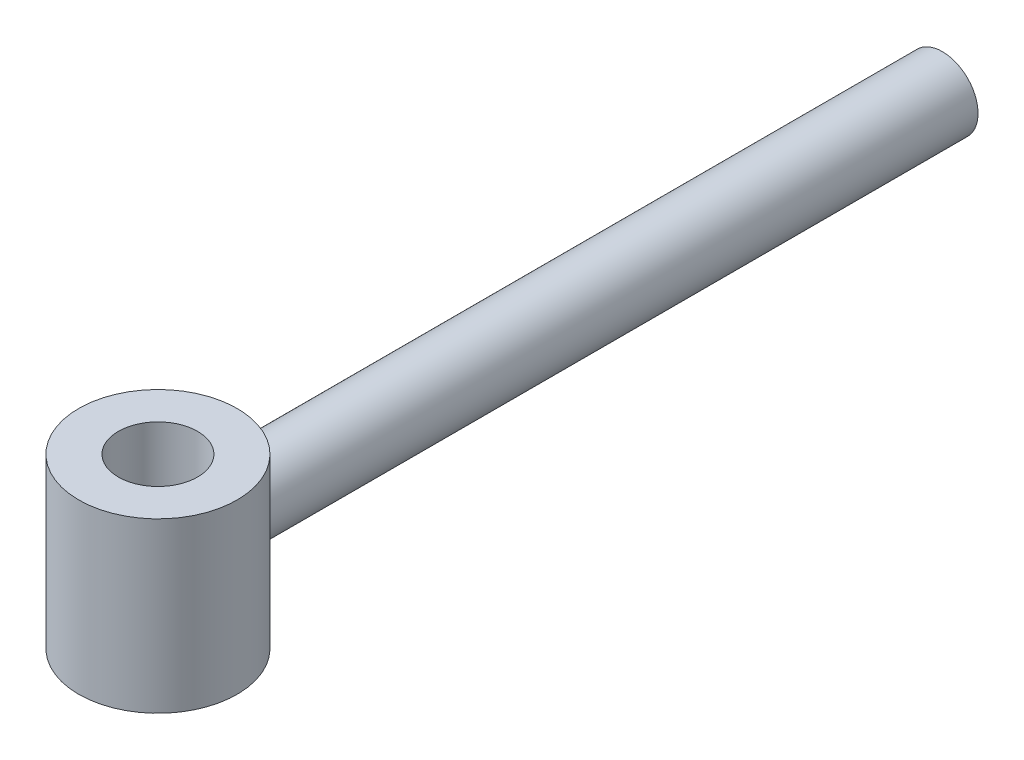
ISO-10303-21;
HEADER;
FILE_DESCRIPTION(('STEP AP214'),'2;1');
FILE_NAME('part.step','',(''),(''),'','','');
FILE_SCHEMA(('AUTOMOTIVE_DESIGN { 1 0 10303 214 1 1 1 1 }'));
ENDSEC;
DATA;
#1=APPLICATION_CONTEXT('core data for automotive mechanical design processes');
#2=APPLICATION_PROTOCOL_DEFINITION('international standard','automotive_design',2000,#1);
#3=PRODUCT_CONTEXT('',#1,'mechanical');
#4=PRODUCT('Part','Part','',(#3));
#5=PRODUCT_RELATED_PRODUCT_CATEGORY('part','',(#4));
#6=PRODUCT_DEFINITION_FORMATION('','',#4);
#7=PRODUCT_DEFINITION_CONTEXT('part definition',#1,'design');
#8=PRODUCT_DEFINITION('design','',#6,#7);
#9=PRODUCT_DEFINITION_SHAPE('','',#8);
#10=(LENGTH_UNIT() NAMED_UNIT(*) SI_UNIT(.MILLI.,.METRE.));
#11=(NAMED_UNIT(*) PLANE_ANGLE_UNIT() SI_UNIT($,.RADIAN.));
#12=(NAMED_UNIT(*) SI_UNIT($,.STERADIAN.) SOLID_ANGLE_UNIT());
#13=UNCERTAINTY_MEASURE_WITH_UNIT(LENGTH_MEASURE(1.E-05),#10,'distance_accuracy_value','');
#14=(GEOMETRIC_REPRESENTATION_CONTEXT(3) GLOBAL_UNCERTAINTY_ASSIGNED_CONTEXT((#13)) GLOBAL_UNIT_ASSIGNED_CONTEXT((#10,
#11,#12)) REPRESENTATION_CONTEXT('',''));
#15=CARTESIAN_POINT('',(0.,0.,0.));
#16=DIRECTION('',(0.,0.,1.));
#17=DIRECTION('',(1.,0.,0.));
#18=AXIS2_PLACEMENT_3D('',#15,#16,#17);
#19=CARTESIAN_POINT('',(0.,40.,-27.));
#20=DIRECTION('',(0.,0.,-1.));
#21=DIRECTION('',(-1.,0.,0.));
#22=AXIS2_PLACEMENT_3D('',#19,#20,#21);
#23=CYLINDRICAL_SURFACE('',#22,18.);
#24=CARTESIAN_POINT('',(0.,40.,-27.));
#25=DIRECTION('',(0.,0.,-1.));
#26=DIRECTION('',(-1.,0.,0.));
#27=AXIS2_PLACEMENT_3D('',#24,#25,#26);
#28=CIRCLE('',#27,18.);
#29=CARTESIAN_POINT('',(-18.,40.,-27.));
#30=VERTEX_POINT('',#29);
#31=EDGE_CURVE('E11',#30,#30,#28,.T.);
#32=ORIENTED_EDGE('',*,*,#31,.T.);
#33=EDGE_LOOP('',(#32));
#34=FACE_BOUND('',#33,.T.);
#35=CARTESIAN_POINT('',(0.,40.,-396.));
#36=DIRECTION('',(0.,0.,-1.));
#37=DIRECTION('',(-1.,0.,0.));
#38=AXIS2_PLACEMENT_3D('',#35,#36,#37);
#39=CIRCLE('',#38,18.);
#40=CARTESIAN_POINT('',(-18.,40.,-396.));
#41=VERTEX_POINT('',#40);
#42=EDGE_CURVE('E50',#41,#41,#39,.T.);
#43=ORIENTED_EDGE('',*,*,#42,.F.);
#44=EDGE_LOOP('',(#43));
#45=FACE_BOUND('',#44,.T.);
#46=ADVANCED_FACE('F44',(#34,#45),#23,.T.);
#47=CARTESIAN_POINT('',(0.,40.,-27.));
#48=DIRECTION('',(0.,0.,-1.));
#49=DIRECTION('',(-1.,0.,0.));
#50=AXIS2_PLACEMENT_3D('',#47,#48,#49);
#51=PLANE('',#50);
#52=ORIENTED_EDGE('',*,*,#31,.F.);
#53=EDGE_LOOP('',(#52));
#54=FACE_BOUND('',#53,.T.);
#55=ADVANCED_FACE('F59',(#54),#51,.F.);
#56=CARTESIAN_POINT('',(0.,40.,-396.));
#57=DIRECTION('',(0.,0.,-1.));
#58=DIRECTION('',(-1.,0.,0.));
#59=AXIS2_PLACEMENT_3D('',#56,#57,#58);
#60=PLANE('',#59);
#61=ORIENTED_EDGE('',*,*,#42,.T.);
#62=EDGE_LOOP('',(#61));
#63=FACE_BOUND('',#62,.T.);
#64=ADVANCED_FACE('F56',(#63),#60,.T.);
#65=CLOSED_SHELL('',(#46,#55,#64));
#66=MANIFOLD_SOLID_BREP('B2',#65);
#67=CARTESIAN_POINT('',(0.,-5.,0.));
#68=DIRECTION('',(0.,1.,0.));
#69=DIRECTION('',(0.,0.,1.));
#70=AXIS2_PLACEMENT_3D('',#67,#68,#69);
#71=CYLINDRICAL_SURFACE('',#70,40.);
#72=CARTESIAN_POINT('',(0.,-5.,0.));
#73=DIRECTION('',(0.,1.,0.));
#74=DIRECTION('',(0.,0.,1.));
#75=AXIS2_PLACEMENT_3D('',#72,#73,#74);
#76=CIRCLE('',#75,40.);
#77=CARTESIAN_POINT('',(0.,-5.,40.));
#78=VERTEX_POINT('',#77);
#79=EDGE_CURVE('E43',#78,#78,#76,.T.);
#80=ORIENTED_EDGE('',*,*,#79,.T.);
#81=EDGE_LOOP('',(#80));
#82=FACE_BOUND('',#81,.T.);
#83=CARTESIAN_POINT('',(0.,80.,0.));
#84=DIRECTION('',(0.,1.,0.));
#85=DIRECTION('',(0.,0.,1.));
#86=AXIS2_PLACEMENT_3D('',#83,#84,#85);
#87=CIRCLE('',#86,40.);
#88=CARTESIAN_POINT('',(0.,80.,40.));
#89=VERTEX_POINT('',#88);
#90=EDGE_CURVE('E100',#89,#89,#87,.T.);
#91=ORIENTED_EDGE('',*,*,#90,.F.);
#92=EDGE_LOOP('',(#91));
#93=FACE_BOUND('',#92,.T.);
#94=ADVANCED_FACE('F90',(#82,#93),#71,.T.);
#95=CARTESIAN_POINT('',(0.,-5.,0.));
#96=DIRECTION('',(0.,1.,0.));
#97=DIRECTION('',(0.,0.,1.));
#98=AXIS2_PLACEMENT_3D('',#95,#96,#97);
#99=PLANE('',#98);
#100=CARTESIAN_POINT('',(0.,-5.,0.));
#101=DIRECTION('',(0.,1.,0.));
#102=DIRECTION('',(0.,0.,1.));
#103=AXIS2_PLACEMENT_3D('',#100,#101,#102);
#104=CIRCLE('',#103,20.);
#105=CARTESIAN_POINT('',(0.,-5.,20.));
#106=VERTEX_POINT('',#105);
#107=EDGE_CURVE('E96',#106,#106,#104,.T.);
#108=ORIENTED_EDGE('',*,*,#107,.T.);
#109=EDGE_LOOP('',(#108));
#110=FACE_BOUND('',#109,.T.);
#111=ORIENTED_EDGE('',*,*,#79,.F.);
#112=EDGE_LOOP('',(#111));
#113=FACE_BOUND('',#112,.T.);
#114=ADVANCED_FACE('F119',(#110,#113),#99,.F.);
#115=CARTESIAN_POINT('',(0.,-5.,0.));
#116=DIRECTION('',(0.,1.,0.));
#117=DIRECTION('',(0.,0.,1.));
#118=AXIS2_PLACEMENT_3D('',#115,#116,#117);
#119=CYLINDRICAL_SURFACE('',#118,20.);
#120=ORIENTED_EDGE('',*,*,#107,.F.);
#121=EDGE_LOOP('',(#120));
#122=FACE_BOUND('',#121,.T.);
#123=CARTESIAN_POINT('',(0.,80.,0.));
#124=DIRECTION('',(0.,1.,0.));
#125=DIRECTION('',(0.,0.,1.));
#126=AXIS2_PLACEMENT_3D('',#123,#124,#125);
#127=CIRCLE('',#126,20.);
#128=CARTESIAN_POINT('',(0.,80.,20.));
#129=VERTEX_POINT('',#128);
#130=EDGE_CURVE('E104',#129,#129,#127,.T.);
#131=ORIENTED_EDGE('',*,*,#130,.T.);
#132=EDGE_LOOP('',(#131));
#133=FACE_BOUND('',#132,.T.);
#134=ADVANCED_FACE('F110',(#122,#133),#119,.F.);
#135=CARTESIAN_POINT('',(0.,80.,0.));
#136=DIRECTION('',(0.,1.,0.));
#137=DIRECTION('',(0.,0.,1.));
#138=AXIS2_PLACEMENT_3D('',#135,#136,#137);
#139=PLANE('',#138);
#140=ORIENTED_EDGE('',*,*,#90,.T.);
#141=EDGE_LOOP('',(#140));
#142=FACE_BOUND('',#141,.T.);
#143=ORIENTED_EDGE('',*,*,#130,.F.);
#144=EDGE_LOOP('',(#143));
#145=FACE_BOUND('',#144,.T.);
#146=ADVANCED_FACE('F112',(#142,#145),#139,.T.);
#147=CLOSED_SHELL('',(#94,#114,#134,#146));
#148=MANIFOLD_SOLID_BREP('B6',#147);
#149=ADVANCED_BREP_SHAPE_REPRESENTATION('',(#18,#66,#148),#14);
#150=SHAPE_DEFINITION_REPRESENTATION(#9,#149);
ENDSEC;
END-ISO-10303-21;
